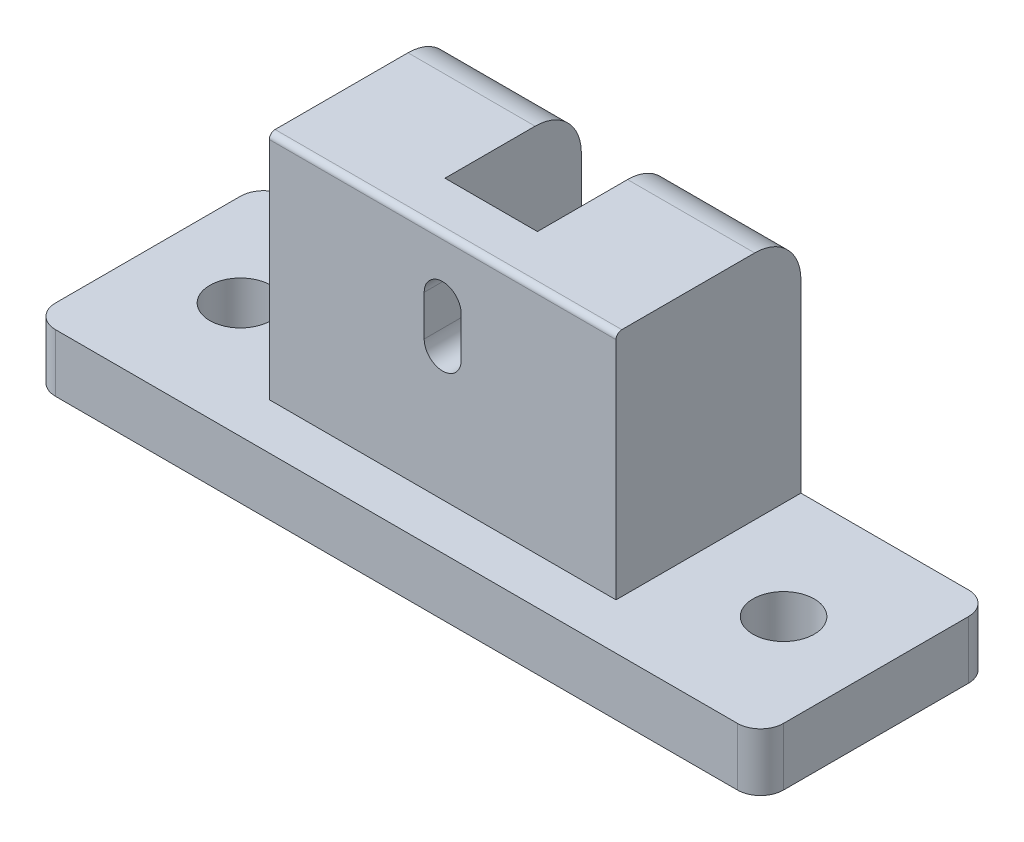
ISO-10303-21;
HEADER;
FILE_DESCRIPTION(('STEP AP214'),'2;1');
FILE_NAME('part.step','',(''),(''),'','','');
FILE_SCHEMA(('AUTOMOTIVE_DESIGN { 1 0 10303 214 1 1 1 1 }'));
ENDSEC;
DATA;
#1=APPLICATION_CONTEXT('core data for automotive mechanical design processes');
#2=APPLICATION_PROTOCOL_DEFINITION('international standard','automotive_design',2000,#1);
#3=PRODUCT_CONTEXT('',#1,'mechanical');
#4=PRODUCT('Part','Part','',(#3));
#5=PRODUCT_RELATED_PRODUCT_CATEGORY('part','',(#4));
#6=PRODUCT_DEFINITION_FORMATION('','',#4);
#7=PRODUCT_DEFINITION_CONTEXT('part definition',#1,'design');
#8=PRODUCT_DEFINITION('design','',#6,#7);
#9=PRODUCT_DEFINITION_SHAPE('','',#8);
#10=(LENGTH_UNIT() NAMED_UNIT(*) SI_UNIT(.MILLI.,.METRE.));
#11=(NAMED_UNIT(*) PLANE_ANGLE_UNIT() SI_UNIT($,.RADIAN.));
#12=(NAMED_UNIT(*) SI_UNIT($,.STERADIAN.) SOLID_ANGLE_UNIT());
#13=UNCERTAINTY_MEASURE_WITH_UNIT(LENGTH_MEASURE(1.E-05),#10,'distance_accuracy_value','');
#14=(GEOMETRIC_REPRESENTATION_CONTEXT(3) GLOBAL_UNCERTAINTY_ASSIGNED_CONTEXT((#13)) GLOBAL_UNIT_ASSIGNED_CONTEXT((#10,
#11,#12)) REPRESENTATION_CONTEXT('',''));
#15=CARTESIAN_POINT('',(0.,0.,0.));
#16=DIRECTION('',(0.,0.,1.));
#17=DIRECTION('',(1.,0.,0.));
#18=AXIS2_PLACEMENT_3D('',#15,#16,#17);
#19=CARTESIAN_POINT('',(31.5,16.25,0.));
#20=DIRECTION('',(0.,0.,-1.));
#21=DIRECTION('',(-1.,0.,0.));
#22=AXIS2_PLACEMENT_3D('',#19,#20,#21);
#23=CYLINDRICAL_SURFACE('',#22,1.59999999999999);
#24=CARTESIAN_POINT('',(31.5,16.25,-8.20000000000001));
#25=DIRECTION('',(0.,0.,-1.));
#26=DIRECTION('',(-1.,0.,0.));
#27=AXIS2_PLACEMENT_3D('',#24,#25,#26);
#28=CIRCLE('',#27,1.59999999999999);
#29=CARTESIAN_POINT('',(33.1,16.25,-8.20000000000001));
#30=VERTEX_POINT('',#29);
#31=CARTESIAN_POINT('',(29.9,16.25,-8.20000000000001));
#32=VERTEX_POINT('',#31);
#33=EDGE_CURVE('E293',#30,#32,#28,.T.);
#34=ORIENTED_EDGE('',*,*,#33,.T.);
#35=DIRECTION('',(0.,0.,1.));
#36=VECTOR('',#35,1.);
#37=CARTESIAN_POINT('',(29.9,16.25,0.));
#38=LINE('',#37,#36);
#39=CARTESIAN_POINT('',(29.9,16.25,-4.00000000000001));
#40=VERTEX_POINT('',#39);
#41=EDGE_CURVE('E163',#32,#40,#38,.T.);
#42=ORIENTED_EDGE('',*,*,#41,.T.);
#43=CARTESIAN_POINT('',(31.5,16.25,-4.00000000000001));
#44=DIRECTION('',(0.,0.,-1.));
#45=DIRECTION('',(-1.,0.,0.));
#46=AXIS2_PLACEMENT_3D('',#43,#44,#45);
#47=CIRCLE('',#46,1.59999999999999);
#48=CARTESIAN_POINT('',(33.1,16.25,-4.00000000000001));
#49=VERTEX_POINT('',#48);
#50=EDGE_CURVE('E275',#40,#49,#47,.F.);
#51=ORIENTED_EDGE('',*,*,#50,.T.);
#52=DIRECTION('',(0.,0.,-1.));
#53=VECTOR('',#52,1.);
#54=CARTESIAN_POINT('',(33.1,16.25,0.));
#55=LINE('',#54,#53);
#56=EDGE_CURVE('E311',#49,#30,#55,.T.);
#57=ORIENTED_EDGE('',*,*,#56,.T.);
#58=EDGE_LOOP('',(#34,#42,#51,#57));
#59=FACE_BOUND('',#58,.T.);
#60=ADVANCED_FACE('F17',(#59),#23,.F.);
#61=CARTESIAN_POINT('',(33.1,19.75,0.));
#62=DIRECTION('',(1.,0.,0.));
#63=DIRECTION('',(0.,0.,-1.));
#64=AXIS2_PLACEMENT_3D('',#61,#62,#63);
#65=PLANE('',#64);
#66=DIRECTION('',(0.,1.,0.));
#67=VECTOR('',#66,1.);
#68=CARTESIAN_POINT('',(33.1,27.,-8.20000000000001));
#69=LINE('',#68,#67);
#70=CARTESIAN_POINT('',(33.1,19.75,-8.20000000000001));
#71=VERTEX_POINT('',#70);
#72=EDGE_CURVE('E280',#71,#30,#69,.F.);
#73=ORIENTED_EDGE('',*,*,#72,.T.);
#74=ORIENTED_EDGE('',*,*,#56,.F.);
#75=DIRECTION('',(0.,1.,0.));
#76=VECTOR('',#75,1.);
#77=CARTESIAN_POINT('',(33.1,27.,-4.00000000000001));
#78=LINE('',#77,#76);
#79=CARTESIAN_POINT('',(33.1,19.75,-4.00000000000001));
#80=VERTEX_POINT('',#79);
#81=EDGE_CURVE('E273',#49,#80,#78,.T.);
#82=ORIENTED_EDGE('',*,*,#81,.T.);
#83=DIRECTION('',(0.,0.,-1.));
#84=VECTOR('',#83,1.);
#85=CARTESIAN_POINT('',(33.1,19.75,0.));
#86=LINE('',#85,#84);
#87=EDGE_CURVE('E308',#80,#71,#86,.T.);
#88=ORIENTED_EDGE('',*,*,#87,.T.);
#89=EDGE_LOOP('',(#73,#74,#82,#88));
#90=FACE_BOUND('',#89,.T.);
#91=ADVANCED_FACE('F667',(#90),#65,.F.);
#92=CARTESIAN_POINT('',(31.5,19.75,0.));
#93=DIRECTION('',(0.,0.,-1.));
#94=DIRECTION('',(-1.,0.,0.));
#95=AXIS2_PLACEMENT_3D('',#92,#93,#94);
#96=CYLINDRICAL_SURFACE('',#95,1.59999999999999);
#97=CARTESIAN_POINT('',(31.5,19.75,-8.20000000000001));
#98=DIRECTION('',(0.,0.,-1.));
#99=DIRECTION('',(-1.,0.,0.));
#100=AXIS2_PLACEMENT_3D('',#97,#98,#99);
#101=CIRCLE('',#100,1.59999999999999);
#102=CARTESIAN_POINT('',(29.9,19.75,-8.20000000000001));
#103=VERTEX_POINT('',#102);
#104=EDGE_CURVE('E289',#103,#71,#101,.T.);
#105=ORIENTED_EDGE('',*,*,#104,.T.);
#106=ORIENTED_EDGE('',*,*,#87,.F.);
#107=CARTESIAN_POINT('',(31.5,19.75,-4.00000000000001));
#108=DIRECTION('',(0.,0.,-1.));
#109=DIRECTION('',(-1.,0.,0.));
#110=AXIS2_PLACEMENT_3D('',#107,#108,#109);
#111=CIRCLE('',#110,1.59999999999999);
#112=CARTESIAN_POINT('',(29.9,19.75,-4.00000000000001));
#113=VERTEX_POINT('',#112);
#114=EDGE_CURVE('E272',#80,#113,#111,.F.);
#115=ORIENTED_EDGE('',*,*,#114,.T.);
#116=DIRECTION('',(0.,0.,1.));
#117=VECTOR('',#116,1.);
#118=CARTESIAN_POINT('',(29.9,19.75,0.));
#119=LINE('',#118,#117);
#120=EDGE_CURVE('E306',#113,#103,#119,.F.);
#121=ORIENTED_EDGE('',*,*,#120,.T.);
#122=EDGE_LOOP('',(#105,#106,#115,#121));
#123=FACE_BOUND('',#122,.T.);
#124=ADVANCED_FACE('F658',(#123),#96,.F.);
#125=CARTESIAN_POINT('',(29.9,19.75,0.));
#126=DIRECTION('',(-1.,0.,0.));
#127=DIRECTION('',(0.,0.,1.));
#128=AXIS2_PLACEMENT_3D('',#125,#126,#127);
#129=PLANE('',#128);
#130=DIRECTION('',(0.,1.,0.));
#131=VECTOR('',#130,1.);
#132=CARTESIAN_POINT('',(29.9,27.,-8.20000000000001));
#133=LINE('',#132,#131);
#134=EDGE_CURVE('E290',#32,#103,#133,.T.);
#135=ORIENTED_EDGE('',*,*,#134,.T.);
#136=ORIENTED_EDGE('',*,*,#120,.F.);
#137=DIRECTION('',(0.,1.,0.));
#138=VECTOR('',#137,1.);
#139=CARTESIAN_POINT('',(29.9,27.,-4.00000000000001));
#140=LINE('',#139,#138);
#141=EDGE_CURVE('E173',#113,#40,#140,.F.);
#142=ORIENTED_EDGE('',*,*,#141,.T.);
#143=ORIENTED_EDGE('',*,*,#41,.F.);
#144=EDGE_LOOP('',(#135,#136,#142,#143));
#145=FACE_BOUND('',#144,.T.);
#146=ADVANCED_FACE('F650',(#145),#129,.F.);
#147=CARTESIAN_POINT('',(0.,24.5,-4.50000000000001));
#148=DIRECTION('',(1.,0.,0.));
#149=DIRECTION('',(0.,0.,-1.));
#150=AXIS2_PLACEMENT_3D('',#147,#148,#149);
#151=CYLINDRICAL_SURFACE('',#150,0.5);
#152=CARTESIAN_POINT('',(46.5,24.5,-4.50000000000001));
#153=DIRECTION('',(1.,0.,0.));
#154=DIRECTION('',(0.,0.,-1.));
#155=AXIS2_PLACEMENT_3D('',#152,#153,#154);
#156=CIRCLE('',#155,0.5);
#157=CARTESIAN_POINT('',(46.5,24.5,-4.00000000000001));
#158=VERTEX_POINT('',#157);
#159=CARTESIAN_POINT('',(46.5,25.,-4.50000000000001));
#160=VERTEX_POINT('',#159);
#161=EDGE_CURVE('E162',#158,#160,#156,.F.);
#162=ORIENTED_EDGE('',*,*,#161,.T.);
#163=DIRECTION('',(1.,0.,0.));
#164=VECTOR('',#163,1.);
#165=CARTESIAN_POINT('',(0.,25.,-4.50000000000001));
#166=LINE('',#165,#164);
#167=CARTESIAN_POINT('',(16.5,25.,-4.50000000000001));
#168=VERTEX_POINT('',#167);
#169=EDGE_CURVE('E160',#160,#168,#166,.F.);
#170=ORIENTED_EDGE('',*,*,#169,.T.);
#171=CARTESIAN_POINT('',(16.5,24.5,-4.50000000000001));
#172=DIRECTION('',(1.,0.,0.));
#173=DIRECTION('',(0.,0.,-1.));
#174=AXIS2_PLACEMENT_3D('',#171,#172,#173);
#175=CIRCLE('',#174,0.5);
#176=CARTESIAN_POINT('',(16.5,24.5,-4.00000000000001));
#177=VERTEX_POINT('',#176);
#178=EDGE_CURVE('E20',#168,#177,#175,.T.);
#179=ORIENTED_EDGE('',*,*,#178,.T.);
#180=DIRECTION('',(-1.,0.,0.));
#181=VECTOR('',#180,1.);
#182=CARTESIAN_POINT('',(46.5,24.5,-4.00000000000001));
#183=LINE('',#182,#181);
#184=EDGE_CURVE('E157',#177,#158,#183,.F.);
#185=ORIENTED_EDGE('',*,*,#184,.T.);
#186=EDGE_LOOP('',(#162,#170,#179,#185));
#187=FACE_BOUND('',#186,.T.);
#188=ADVANCED_FACE('F156',(#187),#151,.T.);
#189=CARTESIAN_POINT('',(27.5,27.,-8.20000000000001));
#190=DIRECTION('',(0.,0.,1.));
#191=DIRECTION('',(1.,0.,0.));
#192=AXIS2_PLACEMENT_3D('',#189,#190,#191);
#193=PLANE('',#192);
#194=DIRECTION('',(0.,1.,0.));
#195=VECTOR('',#194,1.);
#196=CARTESIAN_POINT('',(27.5,27.,-8.20000000000001));
#197=LINE('',#196,#195);
#198=CARTESIAN_POINT('',(27.5,5.,-8.20000000000001));
#199=VERTEX_POINT('',#198);
#200=CARTESIAN_POINT('',(27.5,25.,-8.20000000000001));
#201=VERTEX_POINT('',#200);
#202=EDGE_CURVE('E215',#199,#201,#197,.T.);
#203=ORIENTED_EDGE('',*,*,#202,.T.);
#204=DIRECTION('',(1.,0.,0.));
#205=VECTOR('',#204,1.);
#206=CARTESIAN_POINT('',(0.,25.,-8.20000000000001));
#207=LINE('',#206,#205);
#208=CARTESIAN_POINT('',(35.5,25.,-8.20000000000001));
#209=VERTEX_POINT('',#208);
#210=EDGE_CURVE('E276',#201,#209,#207,.T.);
#211=ORIENTED_EDGE('',*,*,#210,.T.);
#212=DIRECTION('',(0.,1.,0.));
#213=VECTOR('',#212,1.);
#214=CARTESIAN_POINT('',(35.5,27.,-8.20000000000001));
#215=LINE('',#214,#213);
#216=CARTESIAN_POINT('',(35.5,5.,-8.20000000000001));
#217=VERTEX_POINT('',#216);
#218=EDGE_CURVE('E298',#209,#217,#215,.F.);
#219=ORIENTED_EDGE('',*,*,#218,.T.);
#220=DIRECTION('',(1.,0.,0.));
#221=VECTOR('',#220,1.);
#222=CARTESIAN_POINT('',(0.,5.,-8.20000000000001));
#223=LINE('',#222,#221);
#224=EDGE_CURVE('E231',#217,#199,#223,.F.);
#225=ORIENTED_EDGE('',*,*,#224,.T.);
#226=EDGE_LOOP('',(#203,#211,#219,#225));
#227=FACE_BOUND('',#226,.T.);
#228=ORIENTED_EDGE('',*,*,#104,.F.);
#229=ORIENTED_EDGE('',*,*,#134,.F.);
#230=ORIENTED_EDGE('',*,*,#33,.F.);
#231=ORIENTED_EDGE('',*,*,#72,.F.);
#232=EDGE_LOOP('',(#228,#229,#230,#231));
#233=FACE_BOUND('',#232,.T.);
#234=ADVANCED_FACE('F382',(#227,#233),#193,.F.);
#235=CARTESIAN_POINT('',(0.,25.,0.));
#236=DIRECTION('',(0.,-1.,0.));
#237=DIRECTION('',(0.,0.,-1.));
#238=AXIS2_PLACEMENT_3D('',#235,#236,#237);
#239=PLANE('',#238);
#240=DIRECTION('',(-1.,0.,0.));
#241=VECTOR('',#240,1.);
#242=CARTESIAN_POINT('',(0.,25.,-16.));
#243=LINE('',#242,#241);
#244=CARTESIAN_POINT('',(16.5,25.,-16.));
#245=VERTEX_POINT('',#244);
#246=CARTESIAN_POINT('',(27.5,25.,-16.));
#247=VERTEX_POINT('',#246);
#248=EDGE_CURVE('E182',#245,#247,#243,.F.);
#249=ORIENTED_EDGE('',*,*,#248,.F.);
#250=DIRECTION('',(0.,0.,-1.));
#251=VECTOR('',#250,1.);
#252=CARTESIAN_POINT('',(16.5,25.,-12.));
#253=LINE('',#252,#251);
#254=EDGE_CURVE('E185',#245,#168,#253,.F.);
#255=ORIENTED_EDGE('',*,*,#254,.T.);
#256=ORIENTED_EDGE('',*,*,#169,.F.);
#257=DIRECTION('',(0.,0.,1.));
#258=VECTOR('',#257,1.);
#259=CARTESIAN_POINT('',(46.5,25.,-12.));
#260=LINE('',#259,#258);
#261=CARTESIAN_POINT('',(46.5,25.,-16.));
#262=VERTEX_POINT('',#261);
#263=EDGE_CURVE('E251',#160,#262,#260,.F.);
#264=ORIENTED_EDGE('',*,*,#263,.T.);
#265=DIRECTION('',(-1.,0.,0.));
#266=VECTOR('',#265,1.);
#267=CARTESIAN_POINT('',(0.,25.,-16.));
#268=LINE('',#267,#266);
#269=CARTESIAN_POINT('',(35.5,25.,-16.));
#270=VERTEX_POINT('',#269);
#271=EDGE_CURVE('E301',#270,#262,#268,.F.);
#272=ORIENTED_EDGE('',*,*,#271,.F.);
#273=DIRECTION('',(0.,0.,-1.));
#274=VECTOR('',#273,1.);
#275=CARTESIAN_POINT('',(35.5,25.,-8.20000000000001));
#276=LINE('',#275,#274);
#277=EDGE_CURVE('E239',#270,#209,#276,.F.);
#278=ORIENTED_EDGE('',*,*,#277,.T.);
#279=ORIENTED_EDGE('',*,*,#210,.F.);
#280=DIRECTION('',(0.,0.,1.));
#281=VECTOR('',#280,1.);
#282=CARTESIAN_POINT('',(27.5,25.,-8.20000000000001));
#283=LINE('',#282,#281);
#284=EDGE_CURVE('E213',#201,#247,#283,.F.);
#285=ORIENTED_EDGE('',*,*,#284,.T.);
#286=EDGE_LOOP('',(#249,#255,#256,#264,#272,#278,#279,#285));
#287=FACE_BOUND('',#286,.T.);
#288=ADVANCED_FACE('F365',(#287),#239,.F.);
#289=CARTESIAN_POINT('',(46.5,27.,-4.00000000000001));
#290=DIRECTION('',(0.,0.,-1.));
#291=DIRECTION('',(-1.,0.,0.));
#292=AXIS2_PLACEMENT_3D('',#289,#290,#291);
#293=PLANE('',#292);
#294=ORIENTED_EDGE('',*,*,#184,.F.);
#295=DIRECTION('',(0.,1.,0.));
#296=VECTOR('',#295,1.);
#297=CARTESIAN_POINT('',(16.5,27.,-4.00000000000001));
#298=LINE('',#297,#296);
#299=CARTESIAN_POINT('',(16.5,5.,-4.00000000000001));
#300=VERTEX_POINT('',#299);
#301=EDGE_CURVE('E169',#177,#300,#298,.F.);
#302=ORIENTED_EDGE('',*,*,#301,.T.);
#303=DIRECTION('',(1.,0.,0.));
#304=VECTOR('',#303,1.);
#305=CARTESIAN_POINT('',(0.,5.,-4.00000000000001));
#306=LINE('',#305,#304);
#307=CARTESIAN_POINT('',(46.5,5.,-4.00000000000001));
#308=VERTEX_POINT('',#307);
#309=EDGE_CURVE('E261',#300,#308,#306,.T.);
#310=ORIENTED_EDGE('',*,*,#309,.T.);
#311=DIRECTION('',(0.,1.,0.));
#312=VECTOR('',#311,1.);
#313=CARTESIAN_POINT('',(46.5,27.,-4.00000000000001));
#314=LINE('',#313,#312);
#315=EDGE_CURVE('E172',#308,#158,#314,.T.);
#316=ORIENTED_EDGE('',*,*,#315,.T.);
#317=EDGE_LOOP('',(#294,#302,#310,#316));
#318=FACE_BOUND('',#317,.T.);
#319=ORIENTED_EDGE('',*,*,#114,.F.);
#320=ORIENTED_EDGE('',*,*,#81,.F.);
#321=ORIENTED_EDGE('',*,*,#50,.F.);
#322=ORIENTED_EDGE('',*,*,#141,.F.);
#323=EDGE_LOOP('',(#319,#320,#321,#322));
#324=FACE_BOUND('',#323,.T.);
#325=ADVANCED_FACE('F166',(#318,#324),#293,.F.);
#326=CARTESIAN_POINT('',(46.5,27.,-12.));
#327=DIRECTION('',(-1.,0.,0.));
#328=DIRECTION('',(0.,0.,1.));
#329=AXIS2_PLACEMENT_3D('',#326,#327,#328);
#330=PLANE('',#329);
#331=CARTESIAN_POINT('',(46.5,21.,-16.));
#332=DIRECTION('',(-1.,0.,0.));
#333=DIRECTION('',(0.,0.,1.));
#334=AXIS2_PLACEMENT_3D('',#331,#332,#333);
#335=CIRCLE('',#334,4.);
#336=CARTESIAN_POINT('',(46.5,21.,-20.));
#337=VERTEX_POINT('',#336);
#338=EDGE_CURVE('E253',#262,#337,#335,.T.);
#339=ORIENTED_EDGE('',*,*,#338,.F.);
#340=ORIENTED_EDGE('',*,*,#263,.F.);
#341=ORIENTED_EDGE('',*,*,#161,.F.);
#342=ORIENTED_EDGE('',*,*,#315,.F.);
#343=DIRECTION('',(0.,0.,-1.));
#344=VECTOR('',#343,1.);
#345=CARTESIAN_POINT('',(46.5,5.,0.));
#346=LINE('',#345,#344);
#347=CARTESIAN_POINT('',(46.5,5.,-20.));
#348=VERTEX_POINT('',#347);
#349=EDGE_CURVE('E257',#308,#348,#346,.T.);
#350=ORIENTED_EDGE('',*,*,#349,.T.);
#351=DIRECTION('',(0.,1.,0.));
#352=VECTOR('',#351,1.);
#353=CARTESIAN_POINT('',(46.5,5.,-20.));
#354=LINE('',#353,#352);
#355=EDGE_CURVE('E246',#348,#337,#354,.T.);
#356=ORIENTED_EDGE('',*,*,#355,.T.);
#357=EDGE_LOOP('',(#339,#340,#341,#342,#350,#356));
#358=FACE_BOUND('',#357,.T.);
#359=ADVANCED_FACE('F367',(#358),#330,.F.);
#360=CARTESIAN_POINT('',(0.,21.,-16.));
#361=DIRECTION('',(-1.,0.,0.));
#362=DIRECTION('',(0.,0.,1.));
#363=AXIS2_PLACEMENT_3D('',#360,#361,#362);
#364=CYLINDRICAL_SURFACE('',#363,4.);
#365=CARTESIAN_POINT('',(35.5,21.,-16.));
#366=DIRECTION('',(-1.,0.,0.));
#367=DIRECTION('',(0.,0.,1.));
#368=AXIS2_PLACEMENT_3D('',#365,#366,#367);
#369=CIRCLE('',#368,4.);
#370=CARTESIAN_POINT('',(35.5,21.,-20.));
#371=VERTEX_POINT('',#370);
#372=EDGE_CURVE('E242',#371,#270,#369,.F.);
#373=ORIENTED_EDGE('',*,*,#372,.T.);
#374=ORIENTED_EDGE('',*,*,#271,.T.);
#375=ORIENTED_EDGE('',*,*,#338,.T.);
#376=DIRECTION('',(1.,0.,0.));
#377=VECTOR('',#376,1.);
#378=CARTESIAN_POINT('',(0.,21.,-20.));
#379=LINE('',#378,#377);
#380=EDGE_CURVE('E236',#337,#371,#379,.F.);
#381=ORIENTED_EDGE('',*,*,#380,.T.);
#382=EDGE_LOOP('',(#373,#374,#375,#381));
#383=FACE_BOUND('',#382,.T.);
#384=ADVANCED_FACE('F371',(#383),#364,.T.);
#385=CARTESIAN_POINT('',(35.5,27.,-8.20000000000001));
#386=DIRECTION('',(1.,0.,0.));
#387=DIRECTION('',(0.,0.,-1.));
#388=AXIS2_PLACEMENT_3D('',#385,#386,#387);
#389=PLANE('',#388);
#390=ORIENTED_EDGE('',*,*,#372,.F.);
#391=DIRECTION('',(0.,1.,0.));
#392=VECTOR('',#391,1.);
#393=CARTESIAN_POINT('',(35.5,5.,-20.));
#394=LINE('',#393,#392);
#395=CARTESIAN_POINT('',(35.5,5.,-20.));
#396=VERTEX_POINT('',#395);
#397=EDGE_CURVE('E226',#371,#396,#394,.F.);
#398=ORIENTED_EDGE('',*,*,#397,.T.);
#399=DIRECTION('',(0.,0.,-1.));
#400=VECTOR('',#399,1.);
#401=CARTESIAN_POINT('',(35.5,5.,0.));
#402=LINE('',#401,#400);
#403=EDGE_CURVE('E221',#396,#217,#402,.F.);
#404=ORIENTED_EDGE('',*,*,#403,.T.);
#405=ORIENTED_EDGE('',*,*,#218,.F.);
#406=ORIENTED_EDGE('',*,*,#277,.F.);
#407=EDGE_LOOP('',(#390,#398,#404,#405,#406));
#408=FACE_BOUND('',#407,.T.);
#409=ADVANCED_FACE('F378',(#408),#389,.F.);
#410=CARTESIAN_POINT('',(0.,5.,0.));
#411=DIRECTION('',(0.,-1.,0.));
#412=DIRECTION('',(0.,0.,-1.));
#413=AXIS2_PLACEMENT_3D('',#410,#411,#412);
#414=PLANE('',#413);
#415=DIRECTION('',(1.,0.,0.));
#416=VECTOR('',#415,1.);
#417=CARTESIAN_POINT('',(0.,5.,-20.));
#418=LINE('',#417,#416);
#419=CARTESIAN_POINT('',(27.5,5.,-20.));
#420=VERTEX_POINT('',#419);
#421=EDGE_CURVE('E210',#396,#420,#418,.F.);
#422=ORIENTED_EDGE('',*,*,#421,.T.);
#423=DIRECTION('',(0.,0.,1.));
#424=VECTOR('',#423,1.);
#425=CARTESIAN_POINT('',(27.5,5.,-8.20000000000001));
#426=LINE('',#425,#424);
#427=EDGE_CURVE('E218',#420,#199,#426,.T.);
#428=ORIENTED_EDGE('',*,*,#427,.T.);
#429=ORIENTED_EDGE('',*,*,#224,.F.);
#430=ORIENTED_EDGE('',*,*,#403,.F.);
#431=EDGE_LOOP('',(#422,#428,#429,#430));
#432=FACE_BOUND('',#431,.T.);
#433=ADVANCED_FACE('F397',(#432),#414,.F.);
#434=CARTESIAN_POINT('',(27.5,27.,-8.20000000000001));
#435=DIRECTION('',(-1.,0.,0.));
#436=DIRECTION('',(0.,0.,1.));
#437=AXIS2_PLACEMENT_3D('',#434,#435,#436);
#438=PLANE('',#437);
#439=CARTESIAN_POINT('',(27.5,21.,-16.));
#440=DIRECTION('',(-1.,0.,0.));
#441=DIRECTION('',(0.,0.,1.));
#442=AXIS2_PLACEMENT_3D('',#439,#440,#441);
#443=CIRCLE('',#442,4.);
#444=CARTESIAN_POINT('',(27.5,21.,-20.));
#445=VERTEX_POINT('',#444);
#446=EDGE_CURVE('E188',#247,#445,#443,.T.);
#447=ORIENTED_EDGE('',*,*,#446,.F.);
#448=ORIENTED_EDGE('',*,*,#284,.F.);
#449=ORIENTED_EDGE('',*,*,#202,.F.);
#450=ORIENTED_EDGE('',*,*,#427,.F.);
#451=DIRECTION('',(0.,1.,0.));
#452=VECTOR('',#451,1.);
#453=CARTESIAN_POINT('',(27.5,5.,-20.));
#454=LINE('',#453,#452);
#455=EDGE_CURVE('E198',#420,#445,#454,.T.);
#456=ORIENTED_EDGE('',*,*,#455,.T.);
#457=EDGE_LOOP('',(#447,#448,#449,#450,#456));
#458=FACE_BOUND('',#457,.T.);
#459=ADVANCED_FACE('F405',(#458),#438,.F.);
#460=CARTESIAN_POINT('',(0.,21.,-16.));
#461=DIRECTION('',(-1.,0.,0.));
#462=DIRECTION('',(0.,0.,1.));
#463=AXIS2_PLACEMENT_3D('',#460,#461,#462);
#464=CYLINDRICAL_SURFACE('',#463,4.);
#465=CARTESIAN_POINT('',(16.5,21.,-16.));
#466=DIRECTION('',(-1.,0.,0.));
#467=DIRECTION('',(0.,0.,1.));
#468=AXIS2_PLACEMENT_3D('',#465,#466,#467);
#469=CIRCLE('',#468,4.);
#470=CARTESIAN_POINT('',(16.5,21.,-20.));
#471=VERTEX_POINT('',#470);
#472=EDGE_CURVE('E181',#471,#245,#469,.F.);
#473=ORIENTED_EDGE('',*,*,#472,.T.);
#474=ORIENTED_EDGE('',*,*,#248,.T.);
#475=ORIENTED_EDGE('',*,*,#446,.T.);
#476=DIRECTION('',(1.,0.,0.));
#477=VECTOR('',#476,1.);
#478=CARTESIAN_POINT('',(0.,21.,-20.));
#479=LINE('',#478,#477);
#480=EDGE_CURVE('E195',#445,#471,#479,.F.);
#481=ORIENTED_EDGE('',*,*,#480,.T.);
#482=EDGE_LOOP('',(#473,#474,#475,#481));
#483=FACE_BOUND('',#482,.T.);
#484=ADVANCED_FACE('F408',(#483),#464,.T.);
#485=CARTESIAN_POINT('',(16.5,27.,-12.));
#486=DIRECTION('',(1.,0.,0.));
#487=DIRECTION('',(0.,0.,-1.));
#488=AXIS2_PLACEMENT_3D('',#485,#486,#487);
#489=PLANE('',#488);
#490=ORIENTED_EDGE('',*,*,#472,.F.);
#491=DIRECTION('',(0.,1.,0.));
#492=VECTOR('',#491,1.);
#493=CARTESIAN_POINT('',(16.5,5.,-20.));
#494=LINE('',#493,#492);
#495=CARTESIAN_POINT('',(16.5,5.,-20.));
#496=VERTEX_POINT('',#495);
#497=EDGE_CURVE('E197',#471,#496,#494,.F.);
#498=ORIENTED_EDGE('',*,*,#497,.T.);
#499=DIRECTION('',(0.,0.,-1.));
#500=VECTOR('',#499,1.);
#501=CARTESIAN_POINT('',(16.5,5.,0.));
#502=LINE('',#501,#500);
#503=EDGE_CURVE('E179',#496,#300,#502,.F.);
#504=ORIENTED_EDGE('',*,*,#503,.T.);
#505=ORIENTED_EDGE('',*,*,#301,.F.);
#506=ORIENTED_EDGE('',*,*,#178,.F.);
#507=ORIENTED_EDGE('',*,*,#254,.F.);
#508=EDGE_LOOP('',(#490,#498,#504,#505,#506,#507));
#509=FACE_BOUND('',#508,.T.);
#510=ADVANCED_FACE('F176',(#509),#489,.F.);
#511=CARTESIAN_POINT('',(0.,5.,0.));
#512=DIRECTION('',(0.,-1.,0.));
#513=DIRECTION('',(0.,0.,-1.));
#514=AXIS2_PLACEMENT_3D('',#511,#512,#513);
#515=PLANE('',#514);
#516=ORIENTED_EDGE('',*,*,#349,.F.);
#517=ORIENTED_EDGE('',*,*,#309,.F.);
#518=ORIENTED_EDGE('',*,*,#503,.F.);
#519=DIRECTION('',(1.,0.,0.));
#520=VECTOR('',#519,1.);
#521=CARTESIAN_POINT('',(0.,5.,-20.));
#522=LINE('',#521,#520);
#523=CARTESIAN_POINT('',(2.,5.,-20.));
#524=VERTEX_POINT('',#523);
#525=EDGE_CURVE('E203',#496,#524,#522,.F.);
#526=ORIENTED_EDGE('',*,*,#525,.T.);
#527=CARTESIAN_POINT('',(2.,5.,-18.));
#528=DIRECTION('',(0.,-1.,0.));
#529=DIRECTION('',(0.,0.,-1.));
#530=AXIS2_PLACEMENT_3D('',#527,#528,#529);
#531=CIRCLE('',#530,2.);
#532=CARTESIAN_POINT('',(0.,5.,-18.));
#533=VERTEX_POINT('',#532);
#534=EDGE_CURVE('E346',#533,#524,#531,.T.);
#535=ORIENTED_EDGE('',*,*,#534,.F.);
#536=DIRECTION('',(0.,0.,-1.));
#537=VECTOR('',#536,1.);
#538=CARTESIAN_POINT('',(0.,5.,0.));
#539=LINE('',#538,#537);
#540=CARTESIAN_POINT('',(0.,5.,-2.));
#541=VERTEX_POINT('',#540);
#542=EDGE_CURVE('E349',#533,#541,#539,.F.);
#543=ORIENTED_EDGE('',*,*,#542,.T.);
#544=CARTESIAN_POINT('',(2.,5.,-2.));
#545=DIRECTION('',(0.,-1.,0.));
#546=DIRECTION('',(0.,0.,-1.));
#547=AXIS2_PLACEMENT_3D('',#544,#545,#546);
#548=CIRCLE('',#547,2.);
#549=CARTESIAN_POINT('',(2.,5.,0.));
#550=VERTEX_POINT('',#549);
#551=EDGE_CURVE('E334',#550,#541,#548,.T.);
#552=ORIENTED_EDGE('',*,*,#551,.F.);
#553=DIRECTION('',(-1.,0.,0.));
#554=VECTOR('',#553,1.);
#555=CARTESIAN_POINT('',(0.,5.,0.));
#556=LINE('',#555,#554);
#557=CARTESIAN_POINT('',(61.,5.,0.));
#558=VERTEX_POINT('',#557);
#559=EDGE_CURVE('E338',#550,#558,#556,.F.);
#560=ORIENTED_EDGE('',*,*,#559,.T.);
#561=CARTESIAN_POINT('',(61.,5.,-2.));
#562=DIRECTION('',(0.,-1.,0.));
#563=DIRECTION('',(0.,0.,-1.));
#564=AXIS2_PLACEMENT_3D('',#561,#562,#563);
#565=CIRCLE('',#564,2.);
#566=CARTESIAN_POINT('',(63.,5.,-2.));
#567=VERTEX_POINT('',#566);
#568=EDGE_CURVE('E339',#567,#558,#565,.T.);
#569=ORIENTED_EDGE('',*,*,#568,.F.);
#570=DIRECTION('',(0.,0.,1.));
#571=VECTOR('',#570,1.);
#572=CARTESIAN_POINT('',(63.,5.,0.));
#573=LINE('',#572,#571);
#574=CARTESIAN_POINT('',(63.,5.,-18.));
#575=VERTEX_POINT('',#574);
#576=EDGE_CURVE('E431',#567,#575,#573,.F.);
#577=ORIENTED_EDGE('',*,*,#576,.T.);
#578=CARTESIAN_POINT('',(61.,5.,-18.));
#579=DIRECTION('',(0.,-1.,0.));
#580=DIRECTION('',(0.,0.,-1.));
#581=AXIS2_PLACEMENT_3D('',#578,#579,#580);
#582=CIRCLE('',#581,2.);
#583=CARTESIAN_POINT('',(61.,5.,-20.));
#584=VERTEX_POINT('',#583);
#585=EDGE_CURVE('E200',#584,#575,#582,.T.);
#586=ORIENTED_EDGE('',*,*,#585,.F.);
#587=DIRECTION('',(1.,0.,0.));
#588=VECTOR('',#587,1.);
#589=CARTESIAN_POINT('',(0.,5.,-20.));
#590=LINE('',#589,#588);
#591=EDGE_CURVE('E248',#584,#348,#590,.F.);
#592=ORIENTED_EDGE('',*,*,#591,.T.);
#593=EDGE_LOOP('',(#516,#517,#518,#526,#535,#543,#552,#560,#569,#577,#586,#592));
#594=FACE_BOUND('',#593,.T.);
#595=CARTESIAN_POINT('',(55.,5.,-10.));
#596=DIRECTION('',(0.,-1.,0.));
#597=DIRECTION('',(0.,0.,-1.));
#598=AXIS2_PLACEMENT_3D('',#595,#596,#597);
#599=CIRCLE('',#598,2.65);
#600=CARTESIAN_POINT('',(55.,5.,-12.65));
#601=VERTEX_POINT('',#600);
#602=EDGE_CURVE('E260',#601,#601,#599,.T.);
#603=ORIENTED_EDGE('',*,*,#602,.T.);
#604=EDGE_LOOP('',(#603));
#605=FACE_BOUND('',#604,.T.);
#606=CARTESIAN_POINT('',(8.,5.,-10.));
#607=DIRECTION('',(0.,-1.,0.));
#608=DIRECTION('',(0.,0.,-1.));
#609=AXIS2_PLACEMENT_3D('',#606,#607,#608);
#610=CIRCLE('',#609,2.65);
#611=CARTESIAN_POINT('',(8.,5.,-12.65));
#612=VERTEX_POINT('',#611);
#613=EDGE_CURVE('E331',#612,#612,#610,.T.);
#614=ORIENTED_EDGE('',*,*,#613,.T.);
#615=EDGE_LOOP('',(#614));
#616=FACE_BOUND('',#615,.T.);
#617=ADVANCED_FACE('F414',(#594,#605,#616),#515,.F.);
#618=CARTESIAN_POINT('',(55.,5.,-10.));
#619=DIRECTION('',(0.,-1.,0.));
#620=DIRECTION('',(0.,0.,-1.));
#621=AXIS2_PLACEMENT_3D('',#618,#619,#620);
#622=CYLINDRICAL_SURFACE('',#621,2.65);
#623=ORIENTED_EDGE('',*,*,#602,.F.);
#624=EDGE_LOOP('',(#623));
#625=FACE_BOUND('',#624,.T.);
#626=CARTESIAN_POINT('',(55.,0.,-10.));
#627=DIRECTION('',(0.,-1.,0.));
#628=DIRECTION('',(0.,0.,-1.));
#629=AXIS2_PLACEMENT_3D('',#626,#627,#628);
#630=CIRCLE('',#629,2.65);
#631=CARTESIAN_POINT('',(55.,0.,-12.65));
#632=VERTEX_POINT('',#631);
#633=EDGE_CURVE('E328',#632,#632,#630,.F.);
#634=ORIENTED_EDGE('',*,*,#633,.F.);
#635=EDGE_LOOP('',(#634));
#636=FACE_BOUND('',#635,.T.);
#637=ADVANCED_FACE('F557',(#625,#636),#622,.F.);
#638=CARTESIAN_POINT('',(0.,5.,0.));
#639=DIRECTION('',(1.,0.,0.));
#640=DIRECTION('',(0.,0.,-1.));
#641=AXIS2_PLACEMENT_3D('',#638,#639,#640);
#642=PLANE('',#641);
#643=DIRECTION('',(0.,-1.,0.));
#644=VECTOR('',#643,1.);
#645=CARTESIAN_POINT('',(0.,5.,-18.));
#646=LINE('',#645,#644);
#647=CARTESIAN_POINT('',(0.,0.,-18.));
#648=VERTEX_POINT('',#647);
#649=EDGE_CURVE('E206',#648,#533,#646,.F.);
#650=ORIENTED_EDGE('',*,*,#649,.F.);
#651=DIRECTION('',(0.,0.,-1.));
#652=VECTOR('',#651,1.);
#653=CARTESIAN_POINT('',(0.,0.,0.));
#654=LINE('',#653,#652);
#655=CARTESIAN_POINT('',(0.,0.,-2.));
#656=VERTEX_POINT('',#655);
#657=EDGE_CURVE('E327',#656,#648,#654,.T.);
#658=ORIENTED_EDGE('',*,*,#657,.F.);
#659=DIRECTION('',(0.,-1.,0.));
#660=VECTOR('',#659,1.);
#661=CARTESIAN_POINT('',(0.,5.,-2.));
#662=LINE('',#661,#660);
#663=EDGE_CURVE('E337',#541,#656,#662,.T.);
#664=ORIENTED_EDGE('',*,*,#663,.F.);
#665=ORIENTED_EDGE('',*,*,#542,.F.);
#666=EDGE_LOOP('',(#650,#658,#664,#665));
#667=FACE_BOUND('',#666,.T.);
#668=ADVANCED_FACE('F467',(#667),#642,.F.);
#669=CARTESIAN_POINT('',(2.,5.,-18.));
#670=DIRECTION('',(0.,-1.,0.));
#671=DIRECTION('',(0.,0.,-1.));
#672=AXIS2_PLACEMENT_3D('',#669,#670,#671);
#673=CYLINDRICAL_SURFACE('',#672,2.);
#674=CARTESIAN_POINT('',(2.,0.,-18.));
#675=DIRECTION('',(0.,-1.,0.));
#676=DIRECTION('',(0.,0.,-1.));
#677=AXIS2_PLACEMENT_3D('',#674,#675,#676);
#678=CIRCLE('',#677,2.);
#679=CARTESIAN_POINT('',(2.,0.,-20.));
#680=VERTEX_POINT('',#679);
#681=EDGE_CURVE('E324',#648,#680,#678,.T.);
#682=ORIENTED_EDGE('',*,*,#681,.F.);
#683=ORIENTED_EDGE('',*,*,#649,.T.);
#684=ORIENTED_EDGE('',*,*,#534,.T.);
#685=DIRECTION('',(0.,1.,0.));
#686=VECTOR('',#685,1.);
#687=CARTESIAN_POINT('',(2.,5.,-20.));
#688=LINE('',#687,#686);
#689=EDGE_CURVE('E205',#524,#680,#688,.F.);
#690=ORIENTED_EDGE('',*,*,#689,.T.);
#691=EDGE_LOOP('',(#682,#683,#684,#690));
#692=FACE_BOUND('',#691,.T.);
#693=ADVANCED_FACE('F420',(#692),#673,.T.);
#694=CARTESIAN_POINT('',(0.,5.,-20.));
#695=DIRECTION('',(0.,0.,1.));
#696=DIRECTION('',(1.,0.,0.));
#697=AXIS2_PLACEMENT_3D('',#694,#695,#696);
#698=PLANE('',#697);
#699=ORIENTED_EDGE('',*,*,#480,.F.);
#700=ORIENTED_EDGE('',*,*,#455,.F.);
#701=ORIENTED_EDGE('',*,*,#421,.F.);
#702=ORIENTED_EDGE('',*,*,#397,.F.);
#703=ORIENTED_EDGE('',*,*,#380,.F.);
#704=ORIENTED_EDGE('',*,*,#355,.F.);
#705=ORIENTED_EDGE('',*,*,#591,.F.);
#706=DIRECTION('',(0.,-1.,0.));
#707=VECTOR('',#706,1.);
#708=CARTESIAN_POINT('',(61.,5.,-20.));
#709=LINE('',#708,#707);
#710=CARTESIAN_POINT('',(61.,0.,-20.));
#711=VERTEX_POINT('',#710);
#712=EDGE_CURVE('E345',#711,#584,#709,.F.);
#713=ORIENTED_EDGE('',*,*,#712,.F.);
#714=DIRECTION('',(1.,0.,0.));
#715=VECTOR('',#714,1.);
#716=CARTESIAN_POINT('',(0.,0.,-20.));
#717=LINE('',#716,#715);
#718=EDGE_CURVE('E323',#680,#711,#717,.T.);
#719=ORIENTED_EDGE('',*,*,#718,.F.);
#720=ORIENTED_EDGE('',*,*,#689,.F.);
#721=ORIENTED_EDGE('',*,*,#525,.F.);
#722=ORIENTED_EDGE('',*,*,#497,.F.);
#723=EDGE_LOOP('',(#699,#700,#701,#702,#703,#704,#705,#713,#719,#720,#721,#722));
#724=FACE_BOUND('',#723,.T.);
#725=ADVANCED_FACE('F401',(#724),#698,.F.);
#726=CARTESIAN_POINT('',(61.,5.,-18.));
#727=DIRECTION('',(0.,-1.,0.));
#728=DIRECTION('',(0.,0.,-1.));
#729=AXIS2_PLACEMENT_3D('',#726,#727,#728);
#730=CYLINDRICAL_SURFACE('',#729,2.);
#731=CARTESIAN_POINT('',(61.,0.,-18.));
#732=DIRECTION('',(0.,-1.,0.));
#733=DIRECTION('',(0.,0.,-1.));
#734=AXIS2_PLACEMENT_3D('',#731,#732,#733);
#735=CIRCLE('',#734,2.);
#736=CARTESIAN_POINT('',(63.,0.,-18.));
#737=VERTEX_POINT('',#736);
#738=EDGE_CURVE('E320',#711,#737,#735,.T.);
#739=ORIENTED_EDGE('',*,*,#738,.F.);
#740=ORIENTED_EDGE('',*,*,#712,.T.);
#741=ORIENTED_EDGE('',*,*,#585,.T.);
#742=DIRECTION('',(0.,1.,0.));
#743=VECTOR('',#742,1.);
#744=CARTESIAN_POINT('',(63.,5.,-18.));
#745=LINE('',#744,#743);
#746=EDGE_CURVE('E342',#575,#737,#745,.F.);
#747=ORIENTED_EDGE('',*,*,#746,.T.);
#748=EDGE_LOOP('',(#739,#740,#741,#747));
#749=FACE_BOUND('',#748,.T.);
#750=ADVANCED_FACE('F439',(#749),#730,.T.);
#751=CARTESIAN_POINT('',(63.,5.,0.));
#752=DIRECTION('',(-1.,0.,0.));
#753=DIRECTION('',(0.,0.,1.));
#754=AXIS2_PLACEMENT_3D('',#751,#752,#753);
#755=PLANE('',#754);
#756=ORIENTED_EDGE('',*,*,#746,.F.);
#757=ORIENTED_EDGE('',*,*,#576,.F.);
#758=DIRECTION('',(0.,-1.,0.));
#759=VECTOR('',#758,1.);
#760=CARTESIAN_POINT('',(63.,5.,-2.));
#761=LINE('',#760,#759);
#762=CARTESIAN_POINT('',(63.,0.,-2.));
#763=VERTEX_POINT('',#762);
#764=EDGE_CURVE('E341',#763,#567,#761,.F.);
#765=ORIENTED_EDGE('',*,*,#764,.F.);
#766=DIRECTION('',(0.,0.,-1.));
#767=VECTOR('',#766,1.);
#768=CARTESIAN_POINT('',(63.,0.,0.));
#769=LINE('',#768,#767);
#770=EDGE_CURVE('E319',#737,#763,#769,.F.);
#771=ORIENTED_EDGE('',*,*,#770,.F.);
#772=EDGE_LOOP('',(#756,#757,#765,#771));
#773=FACE_BOUND('',#772,.T.);
#774=ADVANCED_FACE('F470',(#773),#755,.F.);
#775=CARTESIAN_POINT('',(61.,5.,-2.));
#776=DIRECTION('',(0.,-1.,0.));
#777=DIRECTION('',(0.,0.,-1.));
#778=AXIS2_PLACEMENT_3D('',#775,#776,#777);
#779=CYLINDRICAL_SURFACE('',#778,2.);
#780=CARTESIAN_POINT('',(61.,0.,-2.));
#781=DIRECTION('',(0.,-1.,0.));
#782=DIRECTION('',(0.,0.,-1.));
#783=AXIS2_PLACEMENT_3D('',#780,#781,#782);
#784=CIRCLE('',#783,2.);
#785=CARTESIAN_POINT('',(61.,0.,0.));
#786=VERTEX_POINT('',#785);
#787=EDGE_CURVE('E316',#763,#786,#784,.T.);
#788=ORIENTED_EDGE('',*,*,#787,.F.);
#789=ORIENTED_EDGE('',*,*,#764,.T.);
#790=ORIENTED_EDGE('',*,*,#568,.T.);
#791=DIRECTION('',(0.,1.,0.));
#792=VECTOR('',#791,1.);
#793=CARTESIAN_POINT('',(61.,5.,0.));
#794=LINE('',#793,#792);
#795=EDGE_CURVE('E429',#558,#786,#794,.F.);
#796=ORIENTED_EDGE('',*,*,#795,.T.);
#797=EDGE_LOOP('',(#788,#789,#790,#796));
#798=FACE_BOUND('',#797,.T.);
#799=ADVANCED_FACE('F462',(#798),#779,.T.);
#800=CARTESIAN_POINT('',(0.,5.,0.));
#801=DIRECTION('',(0.,0.,-1.));
#802=DIRECTION('',(-1.,0.,0.));
#803=AXIS2_PLACEMENT_3D('',#800,#801,#802);
#804=PLANE('',#803);
#805=DIRECTION('',(0.,-1.,0.));
#806=VECTOR('',#805,1.);
#807=CARTESIAN_POINT('',(2.,5.,0.));
#808=LINE('',#807,#806);
#809=CARTESIAN_POINT('',(2.,0.,0.));
#810=VERTEX_POINT('',#809);
#811=EDGE_CURVE('E35',#810,#550,#808,.F.);
#812=ORIENTED_EDGE('',*,*,#811,.F.);
#813=DIRECTION('',(1.,0.,0.));
#814=VECTOR('',#813,1.);
#815=CARTESIAN_POINT('',(0.,0.,0.));
#816=LINE('',#815,#814);
#817=EDGE_CURVE('E315',#786,#810,#816,.F.);
#818=ORIENTED_EDGE('',*,*,#817,.F.);
#819=ORIENTED_EDGE('',*,*,#795,.F.);
#820=ORIENTED_EDGE('',*,*,#559,.F.);
#821=EDGE_LOOP('',(#812,#818,#819,#820));
#822=FACE_BOUND('',#821,.T.);
#823=ADVANCED_FACE('F460',(#822),#804,.F.);
#824=CARTESIAN_POINT('',(2.,5.,-2.));
#825=DIRECTION('',(0.,-1.,0.));
#826=DIRECTION('',(0.,0.,-1.));
#827=AXIS2_PLACEMENT_3D('',#824,#825,#826);
#828=CYLINDRICAL_SURFACE('',#827,2.);
#829=CARTESIAN_POINT('',(2.,0.,-2.));
#830=DIRECTION('',(0.,-1.,0.));
#831=DIRECTION('',(0.,0.,-1.));
#832=AXIS2_PLACEMENT_3D('',#829,#830,#831);
#833=CIRCLE('',#832,2.);
#834=EDGE_CURVE('E26',#810,#656,#833,.T.);
#835=ORIENTED_EDGE('',*,*,#834,.F.);
#836=ORIENTED_EDGE('',*,*,#811,.T.);
#837=ORIENTED_EDGE('',*,*,#551,.T.);
#838=ORIENTED_EDGE('',*,*,#663,.T.);
#839=EDGE_LOOP('',(#835,#836,#837,#838));
#840=FACE_BOUND('',#839,.T.);
#841=ADVANCED_FACE('F466',(#840),#828,.T.);
#842=CARTESIAN_POINT('',(8.,5.,-10.));
#843=DIRECTION('',(0.,-1.,0.));
#844=DIRECTION('',(0.,0.,-1.));
#845=AXIS2_PLACEMENT_3D('',#842,#843,#844);
#846=CYLINDRICAL_SURFACE('',#845,2.65);
#847=ORIENTED_EDGE('',*,*,#613,.F.);
#848=EDGE_LOOP('',(#847));
#849=FACE_BOUND('',#848,.T.);
#850=CARTESIAN_POINT('',(8.,0.,-10.));
#851=DIRECTION('',(0.,-1.,0.));
#852=DIRECTION('',(0.,0.,-1.));
#853=AXIS2_PLACEMENT_3D('',#850,#851,#852);
#854=CIRCLE('',#853,2.65);
#855=CARTESIAN_POINT('',(8.,0.,-12.65));
#856=VERTEX_POINT('',#855);
#857=EDGE_CURVE('E11',#856,#856,#854,.F.);
#858=ORIENTED_EDGE('',*,*,#857,.F.);
#859=EDGE_LOOP('',(#858));
#860=FACE_BOUND('',#859,.T.);
#861=ADVANCED_FACE('F481',(#849,#860),#846,.F.);
#862=CARTESIAN_POINT('',(0.,0.,0.));
#863=DIRECTION('',(0.,-1.,0.));
#864=DIRECTION('',(0.,0.,-1.));
#865=AXIS2_PLACEMENT_3D('',#862,#863,#864);
#866=PLANE('',#865);
#867=ORIENTED_EDGE('',*,*,#857,.T.);
#868=EDGE_LOOP('',(#867));
#869=FACE_BOUND('',#868,.T.);
#870=ORIENTED_EDGE('',*,*,#817,.T.);
#871=ORIENTED_EDGE('',*,*,#834,.T.);
#872=ORIENTED_EDGE('',*,*,#657,.T.);
#873=ORIENTED_EDGE('',*,*,#681,.T.);
#874=ORIENTED_EDGE('',*,*,#718,.T.);
#875=ORIENTED_EDGE('',*,*,#738,.T.);
#876=ORIENTED_EDGE('',*,*,#770,.T.);
#877=ORIENTED_EDGE('',*,*,#787,.T.);
#878=EDGE_LOOP('',(#870,#871,#872,#873,#874,#875,#876,#877));
#879=FACE_BOUND('',#878,.T.);
#880=ORIENTED_EDGE('',*,*,#633,.T.);
#881=EDGE_LOOP('',(#880));
#882=FACE_BOUND('',#881,.T.);
#883=ADVANCED_FACE('F456',(#869,#879,#882),#866,.T.);
#884=CLOSED_SHELL('',(#60,#91,#124,#146,#188,#234,#288,#325,#359,#384,#409,#433,#459,#484,#510,
#617,#637,#668,#693,#725,#750,#774,#799,#823,#841,#861,#883));
#885=MANIFOLD_SOLID_BREP('B1',#884);
#886=ADVANCED_BREP_SHAPE_REPRESENTATION('',(#18,#885),#14);
#887=SHAPE_DEFINITION_REPRESENTATION(#9,#886);
ENDSEC;
END-ISO-10303-21;
